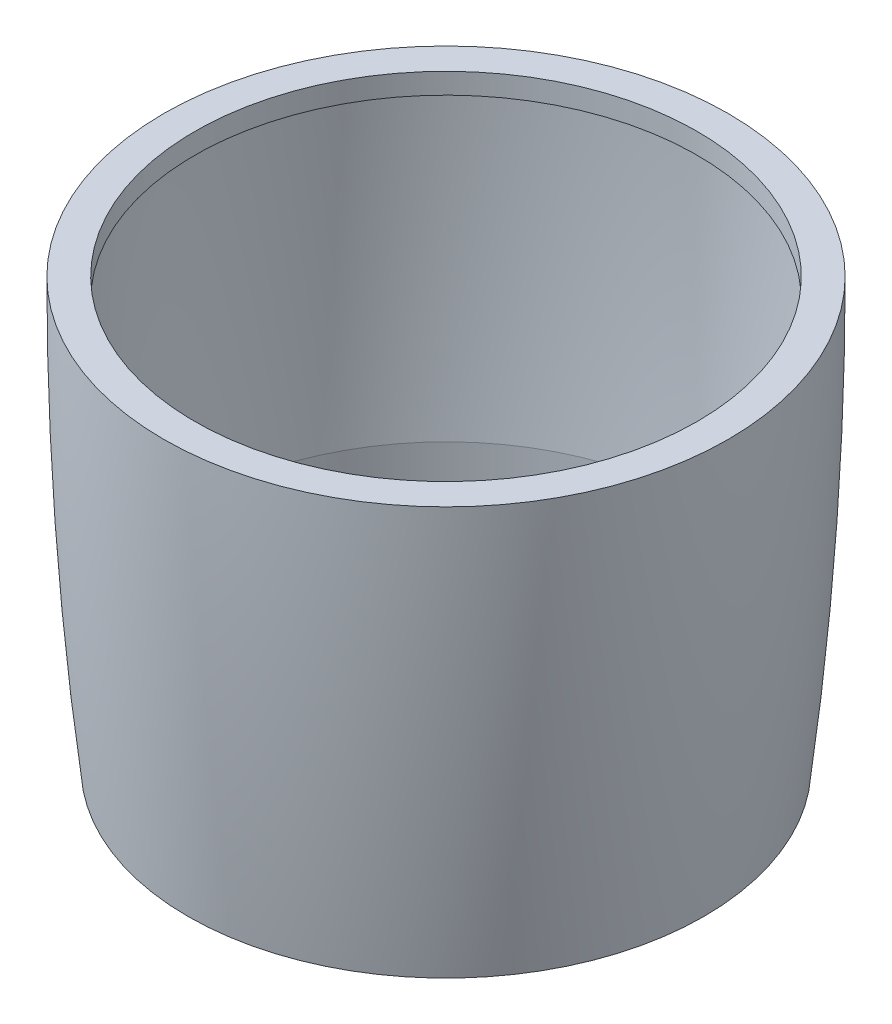
ISO-10303-21;
HEADER;
FILE_DESCRIPTION(('STEP AP214'),'2;1');
FILE_NAME('part.step','',(''),(''),'','','');
FILE_SCHEMA(('AUTOMOTIVE_DESIGN { 1 0 10303 214 1 1 1 1 }'));
ENDSEC;
DATA;
#1=APPLICATION_CONTEXT('core data for automotive mechanical design processes');
#2=APPLICATION_PROTOCOL_DEFINITION('international standard','automotive_design',2000,#1);
#3=PRODUCT_CONTEXT('',#1,'mechanical');
#4=PRODUCT('Part','Part','',(#3));
#5=PRODUCT_RELATED_PRODUCT_CATEGORY('part','',(#4));
#6=PRODUCT_DEFINITION_FORMATION('','',#4);
#7=PRODUCT_DEFINITION_CONTEXT('part definition',#1,'design');
#8=PRODUCT_DEFINITION('design','',#6,#7);
#9=PRODUCT_DEFINITION_SHAPE('','',#8);
#10=(LENGTH_UNIT() NAMED_UNIT(*) SI_UNIT(.MILLI.,.METRE.));
#11=(NAMED_UNIT(*) PLANE_ANGLE_UNIT() SI_UNIT($,.RADIAN.));
#12=(NAMED_UNIT(*) SI_UNIT($,.STERADIAN.) SOLID_ANGLE_UNIT());
#13=UNCERTAINTY_MEASURE_WITH_UNIT(LENGTH_MEASURE(1.E-05),#10,'distance_accuracy_value','');
#14=(GEOMETRIC_REPRESENTATION_CONTEXT(3) GLOBAL_UNCERTAINTY_ASSIGNED_CONTEXT((#13)) GLOBAL_UNIT_ASSIGNED_CONTEXT((#10,
#11,#12)) REPRESENTATION_CONTEXT('',''));
#15=CARTESIAN_POINT('',(0.,0.,0.));
#16=DIRECTION('',(0.,0.,1.));
#17=DIRECTION('',(1.,0.,0.));
#18=AXIS2_PLACEMENT_3D('',#15,#16,#17);
#19=CARTESIAN_POINT('',(3.67997202000078E-12,-1072.80026062135,0.));
#20=DIRECTION('',(0.,-1.,0.));
#21=DIRECTION('',(1.,0.,0.));
#22=AXIS2_PLACEMENT_3D('',#19,#20,#21);
#23=CYLINDRICAL_SURFACE('',#22,18.2500000000001);
#24=CARTESIAN_POINT('',(0.,-23.3065322269204,0.));
#25=DIRECTION('',(0.,-1.,0.));
#26=DIRECTION('',(1.,0.,0.));
#27=AXIS2_PLACEMENT_3D('',#24,#25,#26);
#28=CIRCLE('',#27,18.2500000000001);
#29=CARTESIAN_POINT('',(18.2500000000001,-23.3065322269203,0.));
#30=VERTEX_POINT('',#29);
#31=EDGE_CURVE('E10',#30,#30,#28,.T.);
#32=ORIENTED_EDGE('',*,*,#31,.F.);
#33=EDGE_LOOP('',(#32));
#34=FACE_BOUND('',#33,.T.);
#35=CARTESIAN_POINT('',(1.05930442223051E-13,-30.88126904416,0.));
#36=DIRECTION('',(0.,-1.,0.));
#37=DIRECTION('',(1.,0.,0.));
#38=AXIS2_PLACEMENT_3D('',#35,#36,#37);
#39=CIRCLE('',#38,18.2500000000001);
#40=CARTESIAN_POINT('',(18.2500000000002,-30.8812690441599,0.));
#41=VERTEX_POINT('',#40);
#42=EDGE_CURVE('E73',#41,#41,#39,.T.);
#43=ORIENTED_EDGE('',*,*,#42,.T.);
#44=EDGE_LOOP('',(#43));
#45=FACE_BOUND('',#44,.T.);
#46=ADVANCED_FACE('F42',(#34,#45),#23,.F.);
#47=CARTESIAN_POINT('',(0.,-8.88178419700125E-13,0.));
#48=DIRECTION('',(0.,-1.,0.));
#49=DIRECTION('',(1.,0.,0.));
#50=AXIS2_PLACEMENT_3D('',#47,#48,#49);
#51=DEGENERATE_TOROIDAL_SURFACE('',#50,252.847222222221,272.097222222221,.F.);
#52=CARTESIAN_POINT('',(0.,-1.50000000000006,0.));
#53=DIRECTION('',(0.,-1.,0.));
#54=DIRECTION('',(1.,0.,0.));
#55=AXIS2_PLACEMENT_3D('',#52,#53,#54);
#56=CIRCLE('',#55,19.2458654170072);
#57=CARTESIAN_POINT('',(19.2458654170072,-1.49999999999999,0.));
#58=VERTEX_POINT('',#57);
#59=EDGE_CURVE('E49',#58,#58,#56,.T.);
#60=ORIENTED_EDGE('',*,*,#59,.F.);
#61=EDGE_LOOP('',(#60));
#62=FACE_BOUND('',#61,.T.);
#63=ORIENTED_EDGE('',*,*,#31,.T.);
#64=EDGE_LOOP('',(#63));
#65=FACE_BOUND('',#64,.T.);
#66=ADVANCED_FACE('F105',(#62,#65),#51,.T.);
#67=CARTESIAN_POINT('',(-18.25,-1.5,0.));
#68=DIRECTION('',(0.,1.,0.));
#69=DIRECTION('',(-1.,0.,0.));
#70=AXIS2_PLACEMENT_3D('',#67,#68,#69);
#71=PLANE('',#70);
#72=CARTESIAN_POINT('',(0.,-1.50000000000006,0.));
#73=DIRECTION('',(0.,-1.,0.));
#74=DIRECTION('',(1.,0.,0.));
#75=AXIS2_PLACEMENT_3D('',#72,#73,#74);
#76=CIRCLE('',#75,18.25);
#77=CARTESIAN_POINT('',(18.25,-1.49999999999999,0.));
#78=VERTEX_POINT('',#77);
#79=EDGE_CURVE('E54',#78,#78,#76,.T.);
#80=ORIENTED_EDGE('',*,*,#79,.F.);
#81=EDGE_LOOP('',(#80));
#82=FACE_BOUND('',#81,.T.);
#83=ORIENTED_EDGE('',*,*,#59,.T.);
#84=EDGE_LOOP('',(#83));
#85=FACE_BOUND('',#84,.T.);
#86=ADVANCED_FACE('F100',(#82,#85),#71,.F.);
#87=CARTESIAN_POINT('',(3.67997202000078E-12,-1072.80026062135,0.));
#88=DIRECTION('',(0.,-1.,0.));
#89=DIRECTION('',(1.,0.,0.));
#90=AXIS2_PLACEMENT_3D('',#87,#88,#89);
#91=CYLINDRICAL_SURFACE('',#90,18.25);
#92=CARTESIAN_POINT('',(0.,0.,0.));
#93=DIRECTION('',(0.,-1.,0.));
#94=DIRECTION('',(1.,0.,0.));
#95=AXIS2_PLACEMENT_3D('',#92,#93,#94);
#96=CIRCLE('',#95,18.25);
#97=CARTESIAN_POINT('',(18.25,0.,0.));
#98=VERTEX_POINT('',#97);
#99=EDGE_CURVE('E59',#98,#98,#96,.T.);
#100=ORIENTED_EDGE('',*,*,#99,.F.);
#101=EDGE_LOOP('',(#100));
#102=FACE_BOUND('',#101,.T.);
#103=ORIENTED_EDGE('',*,*,#79,.T.);
#104=EDGE_LOOP('',(#103));
#105=FACE_BOUND('',#104,.T.);
#106=ADVANCED_FACE('F94',(#102,#105),#91,.F.);
#107=CARTESIAN_POINT('',(-20.5,0.,0.));
#108=DIRECTION('',(0.,-1.,0.));
#109=DIRECTION('',(1.,0.,0.));
#110=AXIS2_PLACEMENT_3D('',#107,#108,#109);
#111=PLANE('',#110);
#112=CARTESIAN_POINT('',(0.,0.,0.));
#113=DIRECTION('',(0.,-1.,0.));
#114=DIRECTION('',(1.,0.,0.));
#115=AXIS2_PLACEMENT_3D('',#112,#113,#114);
#116=CIRCLE('',#115,20.5000000000001);
#117=CARTESIAN_POINT('',(20.5000000000001,0.,0.));
#118=VERTEX_POINT('',#117);
#119=EDGE_CURVE('E65',#118,#118,#116,.T.);
#120=ORIENTED_EDGE('',*,*,#119,.F.);
#121=EDGE_LOOP('',(#120));
#122=FACE_BOUND('',#121,.T.);
#123=ORIENTED_EDGE('',*,*,#99,.T.);
#124=EDGE_LOOP('',(#123));
#125=FACE_BOUND('',#124,.T.);
#126=ADVANCED_FACE('F88',(#122,#125),#111,.F.);
#127=CARTESIAN_POINT('',(0.,-8.88178419700125E-13,0.));
#128=DIRECTION('',(0.,-1.,0.));
#129=DIRECTION('',(1.,0.,0.));
#130=AXIS2_PLACEMENT_3D('',#127,#128,#129);
#131=DEGENERATE_TOROIDAL_SURFACE('',#130,252.847222222221,273.347222222221,.F.);
#132=CARTESIAN_POINT('',(1.05930442223051E-13,-30.88126904416,0.));
#133=DIRECTION('',(0.,-1.,0.));
#134=DIRECTION('',(1.,0.,0.));
#135=AXIS2_PLACEMENT_3D('',#132,#133,#134);
#136=CIRCLE('',#135,18.7500000000001);
#137=CARTESIAN_POINT('',(18.7500000000002,-30.8812690441599,0.));
#138=VERTEX_POINT('',#137);
#139=EDGE_CURVE('E69',#138,#138,#136,.T.);
#140=ORIENTED_EDGE('',*,*,#139,.F.);
#141=EDGE_LOOP('',(#140));
#142=FACE_BOUND('',#141,.T.);
#143=ORIENTED_EDGE('',*,*,#119,.T.);
#144=EDGE_LOOP('',(#143));
#145=FACE_BOUND('',#144,.T.);
#146=ADVANCED_FACE('F82',(#142,#145),#131,.F.);
#147=CARTESIAN_POINT('',(-18.25,-30.88126904416,0.));
#148=DIRECTION('',(0.,1.,0.));
#149=DIRECTION('',(-1.,0.,0.));
#150=AXIS2_PLACEMENT_3D('',#147,#148,#149);
#151=PLANE('',#150);
#152=ORIENTED_EDGE('',*,*,#42,.F.);
#153=EDGE_LOOP('',(#152));
#154=FACE_BOUND('',#153,.T.);
#155=ORIENTED_EDGE('',*,*,#139,.T.);
#156=EDGE_LOOP('',(#155));
#157=FACE_BOUND('',#156,.T.);
#158=ADVANCED_FACE('F79',(#154,#157),#151,.F.);
#159=CLOSED_SHELL('',(#46,#66,#86,#106,#126,#146,#158));
#160=MANIFOLD_SOLID_BREP('B2',#159);
#161=ADVANCED_BREP_SHAPE_REPRESENTATION('',(#18,#160),#14);
#162=SHAPE_DEFINITION_REPRESENTATION(#9,#161);
ENDSEC;
END-ISO-10303-21;
